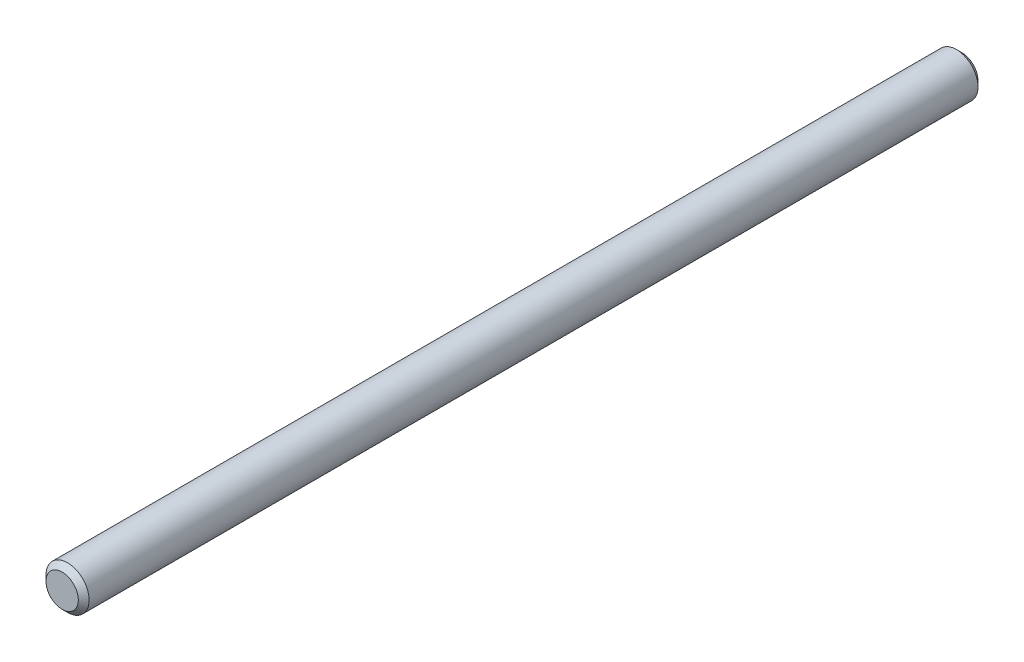
ISO-10303-21;
HEADER;
FILE_DESCRIPTION(('STEP AP214'),'2;1');
FILE_NAME('part.step','',(''),(''),'','','');
FILE_SCHEMA(('AUTOMOTIVE_DESIGN { 1 0 10303 214 1 1 1 1 }'));
ENDSEC;
DATA;
#1=APPLICATION_CONTEXT('core data for automotive mechanical design processes');
#2=APPLICATION_PROTOCOL_DEFINITION('international standard','automotive_design',2000,#1);
#3=PRODUCT_CONTEXT('',#1,'mechanical');
#4=PRODUCT('Part','Part','',(#3));
#5=PRODUCT_RELATED_PRODUCT_CATEGORY('part','',(#4));
#6=PRODUCT_DEFINITION_FORMATION('','',#4);
#7=PRODUCT_DEFINITION_CONTEXT('part definition',#1,'design');
#8=PRODUCT_DEFINITION('design','',#6,#7);
#9=PRODUCT_DEFINITION_SHAPE('','',#8);
#10=(LENGTH_UNIT() NAMED_UNIT(*) SI_UNIT(.MILLI.,.METRE.));
#11=(NAMED_UNIT(*) PLANE_ANGLE_UNIT() SI_UNIT($,.RADIAN.));
#12=(NAMED_UNIT(*) SI_UNIT($,.STERADIAN.) SOLID_ANGLE_UNIT());
#13=UNCERTAINTY_MEASURE_WITH_UNIT(LENGTH_MEASURE(1.E-05),#10,'distance_accuracy_value','');
#14=(GEOMETRIC_REPRESENTATION_CONTEXT(3) GLOBAL_UNCERTAINTY_ASSIGNED_CONTEXT((#13)) GLOBAL_UNIT_ASSIGNED_CONTEXT((#10,
#11,#12)) REPRESENTATION_CONTEXT('',''));
#15=CARTESIAN_POINT('',(0.,0.,0.));
#16=DIRECTION('',(0.,0.,1.));
#17=DIRECTION('',(1.,0.,0.));
#18=AXIS2_PLACEMENT_3D('',#15,#16,#17);
#19=CARTESIAN_POINT('',(0.,0.,243.194937575775));
#20=DIRECTION('',(0.,0.,-1.));
#21=DIRECTION('',(-1.,0.,0.));
#22=AXIS2_PLACEMENT_3D('',#19,#20,#21);
#23=CYLINDRICAL_SURFACE('',#22,4.00000000000002);
#24=CARTESIAN_POINT('',(0.,0.,230.881229076791));
#25=DIRECTION('',(0.,0.,1.));
#26=DIRECTION('',(1.,0.,0.));
#27=AXIS2_PLACEMENT_3D('',#24,#25,#26);
#28=CIRCLE('',#27,4.00000000000002);
#29=CARTESIAN_POINT('',(4.,0.,230.881229076791));
#30=VERTEX_POINT('',#29);
#31=EDGE_CURVE('E38',#30,#30,#28,.F.);
#32=ORIENTED_EDGE('',*,*,#31,.T.);
#33=EDGE_LOOP('',(#32));
#34=FACE_BOUND('',#33,.T.);
#35=CARTESIAN_POINT('',(0.,0.,65.8812290767905));
#36=DIRECTION('',(0.,0.,1.));
#37=DIRECTION('',(1.,0.,0.));
#38=AXIS2_PLACEMENT_3D('',#35,#36,#37);
#39=CIRCLE('',#38,4.00000000000002);
#40=CARTESIAN_POINT('',(4.,0.,65.8812290767905));
#41=VERTEX_POINT('',#40);
#42=EDGE_CURVE('E42',#41,#41,#39,.T.);
#43=ORIENTED_EDGE('',*,*,#42,.T.);
#44=EDGE_LOOP('',(#43));
#45=FACE_BOUND('',#44,.T.);
#46=ADVANCED_FACE('F31',(#34,#45),#23,.T.);
#47=CARTESIAN_POINT('',(0.,0.,64.8812290767905));
#48=DIRECTION('',(0.,0.,1.));
#49=DIRECTION('',(1.,0.,0.));
#50=AXIS2_PLACEMENT_3D('',#47,#48,#49);
#51=PLANE('',#50);
#52=CARTESIAN_POINT('',(0.,0.,64.8812290767905));
#53=DIRECTION('',(0.,0.,1.));
#54=DIRECTION('',(1.,0.,0.));
#55=AXIS2_PLACEMENT_3D('',#52,#53,#54);
#56=CIRCLE('',#55,3.00000000000006);
#57=CARTESIAN_POINT('',(3.00000000000004,0.,64.8812290767905));
#58=VERTEX_POINT('',#57);
#59=EDGE_CURVE('E10',#58,#58,#56,.F.);
#60=ORIENTED_EDGE('',*,*,#59,.T.);
#61=EDGE_LOOP('',(#60));
#62=FACE_BOUND('',#61,.T.);
#63=ADVANCED_FACE('F62',(#62),#51,.F.);
#64=CARTESIAN_POINT('',(14.5322916509722,-11.0672739482671,231.881229076791));
#65=DIRECTION('',(0.,0.,1.));
#66=DIRECTION('',(0.538496681345444,0.842627630795444,0.));
#67=AXIS2_PLACEMENT_3D('',#64,#65,#66);
#68=PLANE('',#67);
#69=CARTESIAN_POINT('',(0.,0.,231.881229076791));
#70=DIRECTION('',(0.,0.,1.));
#71=DIRECTION('',(0.,-1.,0.));
#72=AXIS2_PLACEMENT_3D('',#69,#70,#71);
#73=CIRCLE('',#72,3.00000000000002);
#74=CARTESIAN_POINT('',(0.,-3.00000000000005,231.881229076791));
#75=VERTEX_POINT('',#74);
#76=EDGE_CURVE('E46',#75,#75,#73,.T.);
#77=ORIENTED_EDGE('',*,*,#76,.T.);
#78=EDGE_LOOP('',(#77));
#79=FACE_BOUND('',#78,.T.);
#80=ADVANCED_FACE('F52',(#79),#68,.T.);
#81=CARTESIAN_POINT('',(0.,0.,231.881229076791));
#82=DIRECTION('',(0.,0.,-1.));
#83=DIRECTION('',(-1.,0.,0.));
#84=AXIS2_PLACEMENT_3D('',#81,#82,#83);
#85=CONICAL_SURFACE('',#84,3.00000000000001,0.78539816339744);
#86=ORIENTED_EDGE('',*,*,#31,.F.);
#87=EDGE_LOOP('',(#86));
#88=FACE_BOUND('',#87,.T.);
#89=ORIENTED_EDGE('',*,*,#76,.F.);
#90=EDGE_LOOP('',(#89));
#91=FACE_BOUND('',#90,.T.);
#92=ADVANCED_FACE('F54',(#88,#91),#85,.T.);
#93=CARTESIAN_POINT('',(0.,0.,65.8812290767905));
#94=DIRECTION('',(0.,0.,1.));
#95=DIRECTION('',(1.,0.,0.));
#96=AXIS2_PLACEMENT_3D('',#93,#94,#95);
#97=CONICAL_SURFACE('',#96,4.00000000000002,0.785398163397437);
#98=ORIENTED_EDGE('',*,*,#59,.F.);
#99=EDGE_LOOP('',(#98));
#100=FACE_BOUND('',#99,.T.);
#101=ORIENTED_EDGE('',*,*,#42,.F.);
#102=EDGE_LOOP('',(#101));
#103=FACE_BOUND('',#102,.T.);
#104=ADVANCED_FACE('F33',(#100,#103),#97,.T.);
#105=CLOSED_SHELL('',(#46,#63,#80,#92,#104));
#106=MANIFOLD_SOLID_BREP('B2',#105);
#107=ADVANCED_BREP_SHAPE_REPRESENTATION('',(#18,#106),#14);
#108=SHAPE_DEFINITION_REPRESENTATION(#9,#107);
ENDSEC;
END-ISO-10303-21;
